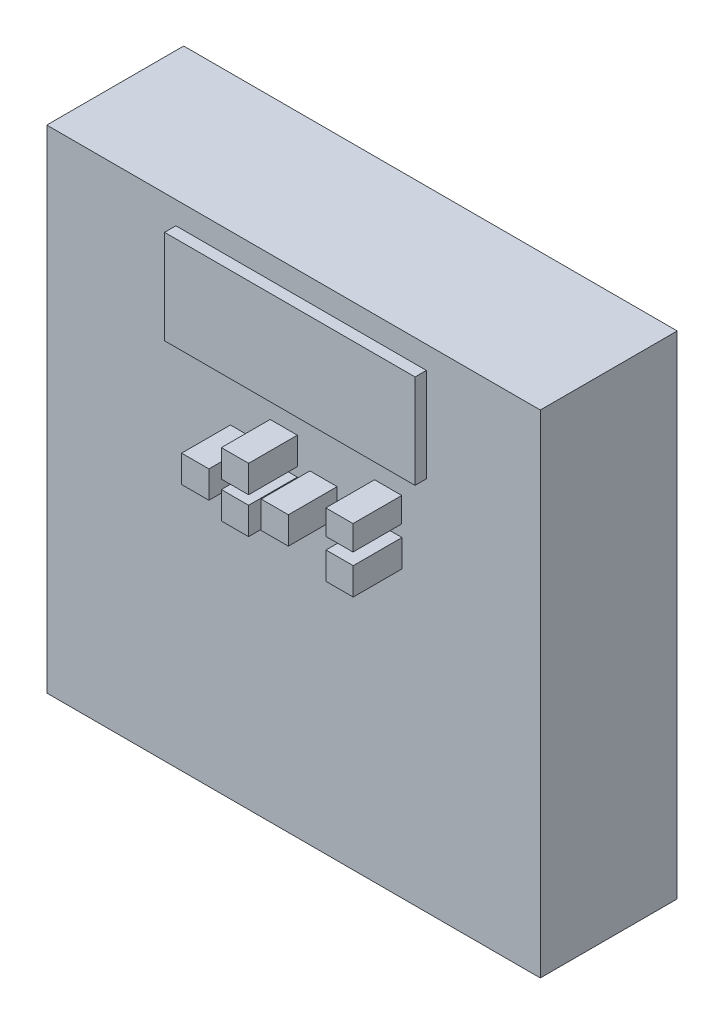
ISO-10303-21;
HEADER;
FILE_DESCRIPTION(('STEP AP214'),'2;1');
FILE_NAME('part.step','',(''),(''),'','','');
FILE_SCHEMA(('AUTOMOTIVE_DESIGN { 1 0 10303 214 1 1 1 1 }'));
ENDSEC;
DATA;
#1=APPLICATION_CONTEXT('core data for automotive mechanical design processes');
#2=APPLICATION_PROTOCOL_DEFINITION('international standard','automotive_design',2000,#1);
#3=PRODUCT_CONTEXT('',#1,'mechanical');
#4=PRODUCT('Part','Part','',(#3));
#5=PRODUCT_RELATED_PRODUCT_CATEGORY('part','',(#4));
#6=PRODUCT_DEFINITION_FORMATION('','',#4);
#7=PRODUCT_DEFINITION_CONTEXT('part definition',#1,'design');
#8=PRODUCT_DEFINITION('design','',#6,#7);
#9=PRODUCT_DEFINITION_SHAPE('','',#8);
#10=(LENGTH_UNIT() NAMED_UNIT(*) SI_UNIT(.MILLI.,.METRE.));
#11=(NAMED_UNIT(*) PLANE_ANGLE_UNIT() SI_UNIT($,.RADIAN.));
#12=(NAMED_UNIT(*) SI_UNIT($,.STERADIAN.) SOLID_ANGLE_UNIT());
#13=UNCERTAINTY_MEASURE_WITH_UNIT(LENGTH_MEASURE(1.E-05),#10,'distance_accuracy_value','');
#14=(GEOMETRIC_REPRESENTATION_CONTEXT(3) GLOBAL_UNCERTAINTY_ASSIGNED_CONTEXT((#13)) GLOBAL_UNIT_ASSIGNED_CONTEXT((#10,
#11,#12)) REPRESENTATION_CONTEXT('',''));
#15=CARTESIAN_POINT('',(0.,0.,0.));
#16=DIRECTION('',(0.,0.,1.));
#17=DIRECTION('',(1.,0.,0.));
#18=AXIS2_PLACEMENT_3D('',#15,#16,#17);
#19=CARTESIAN_POINT('',(0.,0.,30.6832));
#20=DIRECTION('',(0.,0.,1.));
#21=DIRECTION('',(1.,0.,0.));
#22=AXIS2_PLACEMENT_3D('',#19,#20,#21);
#23=PLANE('',#22);
#24=DIRECTION('',(0.,-1.,0.));
#25=VECTOR('',#24,1.);
#26=CARTESIAN_POINT('',(-55.2958,-55.11165,30.6832));
#27=LINE('',#26,#25);
#28=CARTESIAN_POINT('',(-55.2958,55.11165,30.6832));
#29=VERTEX_POINT('',#28);
#30=CARTESIAN_POINT('',(-55.2958,-55.11165,30.6832));
#31=VERTEX_POINT('',#30);
#32=EDGE_CURVE('E447',#29,#31,#27,.T.);
#33=ORIENTED_EDGE('',*,*,#32,.T.);
#34=DIRECTION('',(1.,0.,0.));
#35=VECTOR('',#34,1.);
#36=CARTESIAN_POINT('',(55.2958,-55.11165,30.6832));
#37=LINE('',#36,#35);
#38=CARTESIAN_POINT('',(55.2958,-55.11165,30.6832));
#39=VERTEX_POINT('',#38);
#40=EDGE_CURVE('E450',#31,#39,#37,.T.);
#41=ORIENTED_EDGE('',*,*,#40,.T.);
#42=DIRECTION('',(0.,1.,0.));
#43=VECTOR('',#42,1.);
#44=CARTESIAN_POINT('',(55.2958,-55.11165,30.6832));
#45=LINE('',#44,#43);
#46=CARTESIAN_POINT('',(55.2958,55.11165,30.6832));
#47=VERTEX_POINT('',#46);
#48=EDGE_CURVE('E453',#39,#47,#45,.T.);
#49=ORIENTED_EDGE('',*,*,#48,.T.);
#50=DIRECTION('',(-1.,0.,0.));
#51=VECTOR('',#50,1.);
#52=CARTESIAN_POINT('',(55.2958,55.11165,30.6832));
#53=LINE('',#52,#51);
#54=EDGE_CURVE('E455',#47,#29,#53,.T.);
#55=ORIENTED_EDGE('',*,*,#54,.T.);
#56=EDGE_LOOP('',(#33,#41,#49,#55));
#57=FACE_BOUND('',#56,.T.);
#58=DIRECTION('',(1.,0.,0.));
#59=VECTOR('',#58,1.);
#60=CARTESIAN_POINT('',(-26.3652,28.98775,30.6832));
#61=LINE('',#60,#59);
#62=CARTESIAN_POINT('',(-26.3652,28.98775,30.6832));
#63=VERTEX_POINT('',#62);
#64=CARTESIAN_POINT('',(29.7688,28.98775,30.6832));
#65=VERTEX_POINT('',#64);
#66=EDGE_CURVE('E431',#63,#65,#61,.T.);
#67=ORIENTED_EDGE('',*,*,#66,.F.);
#68=DIRECTION('',(0.,-1.,0.));
#69=VECTOR('',#68,1.);
#70=CARTESIAN_POINT('',(-26.3652,50.03165,30.6832));
#71=LINE('',#70,#69);
#72=CARTESIAN_POINT('',(-26.3652,50.03165,30.6832));
#73=VERTEX_POINT('',#72);
#74=EDGE_CURVE('E417',#73,#63,#71,.T.);
#75=ORIENTED_EDGE('',*,*,#74,.F.);
#76=DIRECTION('',(-1.,0.,0.));
#77=VECTOR('',#76,1.);
#78=CARTESIAN_POINT('',(-26.3652,50.03165,30.6832));
#79=LINE('',#78,#77);
#80=CARTESIAN_POINT('',(29.7688,50.03165,30.6832));
#81=VERTEX_POINT('',#80);
#82=EDGE_CURVE('E422',#81,#73,#79,.T.);
#83=ORIENTED_EDGE('',*,*,#82,.F.);
#84=DIRECTION('',(0.,1.,0.));
#85=VECTOR('',#84,1.);
#86=CARTESIAN_POINT('',(29.7688,50.03165,30.6832));
#87=LINE('',#86,#85);
#88=EDGE_CURVE('E433',#65,#81,#87,.T.);
#89=ORIENTED_EDGE('',*,*,#88,.F.);
#90=EDGE_LOOP('',(#67,#75,#83,#89));
#91=FACE_BOUND('',#90,.T.);
#92=DIRECTION('',(-1.,0.,0.));
#93=VECTOR('',#92,1.);
#94=CARTESIAN_POINT('',(0.850899999999997,23.00605,30.6832));
#95=LINE('',#94,#93);
#96=CARTESIAN_POINT('',(0.850899999999997,23.00605,30.6832));
#97=VERTEX_POINT('',#96);
#98=CARTESIAN_POINT('',(-5.2451,23.00605,30.6832));
#99=VERTEX_POINT('',#98);
#100=EDGE_CURVE('E402',#97,#99,#95,.T.);
#101=ORIENTED_EDGE('',*,*,#100,.F.);
#102=DIRECTION('',(0.,1.,0.));
#103=VECTOR('',#102,1.);
#104=CARTESIAN_POINT('',(0.850899999999997,16.89735,30.6832));
#105=LINE('',#104,#103);
#106=CARTESIAN_POINT('',(0.850899999999997,16.89735,30.6832));
#107=VERTEX_POINT('',#106);
#108=EDGE_CURVE('E388',#107,#97,#105,.T.);
#109=ORIENTED_EDGE('',*,*,#108,.F.);
#110=DIRECTION('',(1.,0.,0.));
#111=VECTOR('',#110,1.);
#112=CARTESIAN_POINT('',(0.850899999999997,16.89735,30.6832));
#113=LINE('',#112,#111);
#114=CARTESIAN_POINT('',(-5.2451,16.89735,30.6832));
#115=VERTEX_POINT('',#114);
#116=EDGE_CURVE('E393',#115,#107,#113,.T.);
#117=ORIENTED_EDGE('',*,*,#116,.F.);
#118=DIRECTION('',(0.,-1.,0.));
#119=VECTOR('',#118,1.);
#120=CARTESIAN_POINT('',(-5.2451,16.89735,30.6832));
#121=LINE('',#120,#119);
#122=EDGE_CURVE('E404',#99,#115,#121,.T.);
#123=ORIENTED_EDGE('',*,*,#122,.F.);
#124=EDGE_LOOP('',(#101,#109,#117,#123));
#125=FACE_BOUND('',#124,.T.);
#126=DIRECTION('',(1.,0.,0.));
#127=VECTOR('',#126,1.);
#128=CARTESIAN_POINT('',(-14.1478,11.38555,30.6832));
#129=LINE('',#128,#127);
#130=CARTESIAN_POINT('',(-14.1478,11.38555,30.6832));
#131=VERTEX_POINT('',#130);
#132=CARTESIAN_POINT('',(-8.0391,11.38555,30.6832));
#133=VERTEX_POINT('',#132);
#134=EDGE_CURVE('E373',#131,#133,#129,.T.);
#135=ORIENTED_EDGE('',*,*,#134,.F.);
#136=DIRECTION('',(0.,-1.,0.));
#137=VECTOR('',#136,1.);
#138=CARTESIAN_POINT('',(-14.1478,17.48155,30.6832));
#139=LINE('',#138,#137);
#140=CARTESIAN_POINT('',(-14.1478,17.48155,30.6832));
#141=VERTEX_POINT('',#140);
#142=EDGE_CURVE('E359',#141,#131,#139,.T.);
#143=ORIENTED_EDGE('',*,*,#142,.F.);
#144=DIRECTION('',(-1.,0.,0.));
#145=VECTOR('',#144,1.);
#146=CARTESIAN_POINT('',(-14.1478,17.48155,30.6832));
#147=LINE('',#146,#145);
#148=CARTESIAN_POINT('',(-8.0391,17.48155,30.6832));
#149=VERTEX_POINT('',#148);
#150=EDGE_CURVE('E364',#149,#141,#147,.T.);
#151=ORIENTED_EDGE('',*,*,#150,.F.);
#152=DIRECTION('',(0.,1.,0.));
#153=VECTOR('',#152,1.);
#154=CARTESIAN_POINT('',(-8.0391,17.48155,30.6832));
#155=LINE('',#154,#153);
#156=EDGE_CURVE('E375',#133,#149,#155,.T.);
#157=ORIENTED_EDGE('',*,*,#156,.F.);
#158=EDGE_LOOP('',(#135,#143,#151,#157));
#159=FACE_BOUND('',#158,.T.);
#160=DIRECTION('',(1.,0.,0.));
#161=VECTOR('',#160,1.);
#162=CARTESIAN_POINT('',(3.6703,11.38555,30.6832));
#163=LINE('',#162,#161);
#164=CARTESIAN_POINT('',(3.6703,11.38555,30.6832));
#165=VERTEX_POINT('',#164);
#166=CARTESIAN_POINT('',(9.76884,11.38555,30.6832));
#167=VERTEX_POINT('',#166);
#168=EDGE_CURVE('E344',#165,#167,#163,.T.);
#169=ORIENTED_EDGE('',*,*,#168,.F.);
#170=DIRECTION('',(0.,-1.,0.));
#171=VECTOR('',#170,1.);
#172=CARTESIAN_POINT('',(3.6703,17.48155,30.6832));
#173=LINE('',#172,#171);
#174=CARTESIAN_POINT('',(3.6703,17.48155,30.6832));
#175=VERTEX_POINT('',#174);
#176=EDGE_CURVE('E330',#175,#165,#173,.T.);
#177=ORIENTED_EDGE('',*,*,#176,.F.);
#178=DIRECTION('',(-1.,0.,0.));
#179=VECTOR('',#178,1.);
#180=CARTESIAN_POINT('',(3.6703,17.48155,30.6832));
#181=LINE('',#180,#179);
#182=CARTESIAN_POINT('',(9.76884,17.48155,30.6832));
#183=VERTEX_POINT('',#182);
#184=EDGE_CURVE('E335',#183,#175,#181,.T.);
#185=ORIENTED_EDGE('',*,*,#184,.F.);
#186=DIRECTION('',(0.,1.,0.));
#187=VECTOR('',#186,1.);
#188=CARTESIAN_POINT('',(9.76884,17.48155,30.6832));
#189=LINE('',#188,#187);
#190=EDGE_CURVE('E346',#167,#183,#189,.T.);
#191=ORIENTED_EDGE('',*,*,#190,.F.);
#192=EDGE_LOOP('',(#169,#177,#185,#191));
#193=FACE_BOUND('',#192,.T.);
#194=DIRECTION('',(1.,0.,0.));
#195=VECTOR('',#194,1.);
#196=CARTESIAN_POINT('',(-5.2451,8.76935,30.6832));
#197=LINE('',#196,#195);
#198=CARTESIAN_POINT('',(-5.2451,8.76935,30.6832));
#199=VERTEX_POINT('',#198);
#200=CARTESIAN_POINT('',(0.850899999999998,8.76935,30.6832));
#201=VERTEX_POINT('',#200);
#202=EDGE_CURVE('E315',#199,#201,#197,.T.);
#203=ORIENTED_EDGE('',*,*,#202,.F.);
#204=DIRECTION('',(0.,-1.,0.));
#205=VECTOR('',#204,1.);
#206=CARTESIAN_POINT('',(-5.2451,14.86535,30.6832));
#207=LINE('',#206,#205);
#208=CARTESIAN_POINT('',(-5.2451,14.86535,30.6832));
#209=VERTEX_POINT('',#208);
#210=EDGE_CURVE('E301',#209,#199,#207,.T.);
#211=ORIENTED_EDGE('',*,*,#210,.F.);
#212=DIRECTION('',(-1.,0.,0.));
#213=VECTOR('',#212,1.);
#214=CARTESIAN_POINT('',(-5.2451,14.86535,30.6832));
#215=LINE('',#214,#213);
#216=CARTESIAN_POINT('',(0.850899999999997,14.86535,30.6832));
#217=VERTEX_POINT('',#216);
#218=EDGE_CURVE('E306',#217,#209,#215,.T.);
#219=ORIENTED_EDGE('',*,*,#218,.F.);
#220=DIRECTION('',(0.,1.,0.));
#221=VECTOR('',#220,1.);
#222=CARTESIAN_POINT('',(0.850899999999997,14.86535,30.6832));
#223=LINE('',#222,#221);
#224=EDGE_CURVE('E317',#201,#217,#223,.T.);
#225=ORIENTED_EDGE('',*,*,#224,.F.);
#226=EDGE_LOOP('',(#203,#211,#219,#225));
#227=FACE_BOUND('',#226,.T.);
#228=DIRECTION('',(1.,0.,0.));
#229=VECTOR('',#228,1.);
#230=CARTESIAN_POINT('',(18.15084,17.48155,30.6832));
#231=LINE('',#230,#229);
#232=CARTESIAN_POINT('',(18.15084,17.48155,30.6832));
#233=VERTEX_POINT('',#232);
#234=CARTESIAN_POINT('',(24.24684,17.48155,30.6832));
#235=VERTEX_POINT('',#234);
#236=EDGE_CURVE('E273',#233,#235,#231,.T.);
#237=ORIENTED_EDGE('',*,*,#236,.F.);
#238=DIRECTION('',(0.,-1.,0.));
#239=VECTOR('',#238,1.);
#240=CARTESIAN_POINT('',(18.15084,23.00605,30.6832));
#241=LINE('',#240,#239);
#242=CARTESIAN_POINT('',(18.15084,23.00605,30.6832));
#243=VERTEX_POINT('',#242);
#244=EDGE_CURVE('E270',#243,#233,#241,.T.);
#245=ORIENTED_EDGE('',*,*,#244,.F.);
#246=DIRECTION('',(-1.,0.,0.));
#247=VECTOR('',#246,1.);
#248=CARTESIAN_POINT('',(18.15084,23.00605,30.6832));
#249=LINE('',#248,#247);
#250=CARTESIAN_POINT('',(24.24684,23.00605,30.6832));
#251=VERTEX_POINT('',#250);
#252=EDGE_CURVE('E282',#251,#243,#249,.T.);
#253=ORIENTED_EDGE('',*,*,#252,.F.);
#254=DIRECTION('',(0.,1.,0.));
#255=VECTOR('',#254,1.);
#256=CARTESIAN_POINT('',(24.24684,23.00605,30.6832));
#257=LINE('',#256,#255);
#258=EDGE_CURVE('E290',#235,#251,#257,.T.);
#259=ORIENTED_EDGE('',*,*,#258,.F.);
#260=EDGE_LOOP('',(#237,#245,#253,#259));
#261=FACE_BOUND('',#260,.T.);
#262=DIRECTION('',(1.,0.,0.));
#263=VECTOR('',#262,1.);
#264=CARTESIAN_POINT('',(18.1991,8.76935,30.6832));
#265=LINE('',#264,#263);
#266=CARTESIAN_POINT('',(18.1991,8.76935,30.6832));
#267=VERTEX_POINT('',#266);
#268=CARTESIAN_POINT('',(24.2951,8.76935,30.6832));
#269=VERTEX_POINT('',#268);
#270=EDGE_CURVE('E859',#267,#269,#265,.T.);
#271=ORIENTED_EDGE('',*,*,#270,.F.);
#272=DIRECTION('',(0.,-1.,0.));
#273=VECTOR('',#272,1.);
#274=CARTESIAN_POINT('',(18.1991,14.86535,30.6832));
#275=LINE('',#274,#273);
#276=CARTESIAN_POINT('',(18.1991,14.86535,30.6832));
#277=VERTEX_POINT('',#276);
#278=EDGE_CURVE('E268',#277,#267,#275,.T.);
#279=ORIENTED_EDGE('',*,*,#278,.F.);
#280=DIRECTION('',(-1.,0.,0.));
#281=VECTOR('',#280,1.);
#282=CARTESIAN_POINT('',(18.1991,14.86535,30.6832));
#283=LINE('',#282,#281);
#284=CARTESIAN_POINT('',(24.2951,14.86535,30.6832));
#285=VERTEX_POINT('',#284);
#286=EDGE_CURVE('E264',#285,#277,#283,.T.);
#287=ORIENTED_EDGE('',*,*,#286,.F.);
#288=DIRECTION('',(0.,1.,0.));
#289=VECTOR('',#288,1.);
#290=CARTESIAN_POINT('',(24.2951,14.86535,30.6832));
#291=LINE('',#290,#289);
#292=EDGE_CURVE('E856',#269,#285,#291,.T.);
#293=ORIENTED_EDGE('',*,*,#292,.F.);
#294=EDGE_LOOP('',(#271,#279,#287,#293));
#295=FACE_BOUND('',#294,.T.);
#296=ADVANCED_FACE('F35',(#57,#91,#125,#159,#193,#227,#261,#295),#23,.T.);
#297=CARTESIAN_POINT('',(-55.2958,-55.11165,30.6832));
#298=DIRECTION('',(1.,0.,0.));
#299=DIRECTION('',(0.,0.,-1.));
#300=AXIS2_PLACEMENT_3D('',#297,#298,#299);
#301=PLANE('',#300);
#302=DIRECTION('',(0.,-1.,0.));
#303=VECTOR('',#302,1.);
#304=CARTESIAN_POINT('',(-55.2958,-55.11165,0.));
#305=LINE('',#304,#303);
#306=CARTESIAN_POINT('',(-55.2958,55.11165,0.));
#307=VERTEX_POINT('',#306);
#308=CARTESIAN_POINT('',(-55.2958,-55.11165,0.));
#309=VERTEX_POINT('',#308);
#310=EDGE_CURVE('E446',#307,#309,#305,.T.);
#311=ORIENTED_EDGE('',*,*,#310,.T.);
#312=DIRECTION('',(0.,0.,-1.));
#313=VECTOR('',#312,1.);
#314=CARTESIAN_POINT('',(-55.2958,-55.11165,30.6832));
#315=LINE('',#314,#313);
#316=EDGE_CURVE('E11',#31,#309,#315,.T.);
#317=ORIENTED_EDGE('',*,*,#316,.F.);
#318=ORIENTED_EDGE('',*,*,#32,.F.);
#319=DIRECTION('',(0.,0.,-1.));
#320=VECTOR('',#319,1.);
#321=CARTESIAN_POINT('',(-55.2958,55.11165,30.6832));
#322=LINE('',#321,#320);
#323=EDGE_CURVE('E457',#29,#307,#322,.T.);
#324=ORIENTED_EDGE('',*,*,#323,.T.);
#325=EDGE_LOOP('',(#311,#317,#318,#324));
#326=FACE_BOUND('',#325,.T.);
#327=ADVANCED_FACE('F37',(#326),#301,.F.);
#328=CARTESIAN_POINT('',(55.2958,-55.11165,30.6832));
#329=DIRECTION('',(0.,1.,0.));
#330=DIRECTION('',(0.,0.,1.));
#331=AXIS2_PLACEMENT_3D('',#328,#329,#330);
#332=PLANE('',#331);
#333=DIRECTION('',(1.,0.,0.));
#334=VECTOR('',#333,1.);
#335=CARTESIAN_POINT('',(55.2958,-55.11165,0.));
#336=LINE('',#335,#334);
#337=CARTESIAN_POINT('',(55.2958,-55.11165,0.));
#338=VERTEX_POINT('',#337);
#339=EDGE_CURVE('E460',#309,#338,#336,.T.);
#340=ORIENTED_EDGE('',*,*,#339,.T.);
#341=DIRECTION('',(0.,0.,-1.));
#342=VECTOR('',#341,1.);
#343=CARTESIAN_POINT('',(55.2958,-55.11165,30.6832));
#344=LINE('',#343,#342);
#345=EDGE_CURVE('E43',#39,#338,#344,.T.);
#346=ORIENTED_EDGE('',*,*,#345,.F.);
#347=ORIENTED_EDGE('',*,*,#40,.F.);
#348=ORIENTED_EDGE('',*,*,#316,.T.);
#349=EDGE_LOOP('',(#340,#346,#347,#348));
#350=FACE_BOUND('',#349,.T.);
#351=ADVANCED_FACE('F490',(#350),#332,.F.);
#352=CARTESIAN_POINT('',(55.2958,-55.11165,30.6832));
#353=DIRECTION('',(-1.,0.,0.));
#354=DIRECTION('',(0.,0.,1.));
#355=AXIS2_PLACEMENT_3D('',#352,#353,#354);
#356=PLANE('',#355);
#357=DIRECTION('',(0.,1.,0.));
#358=VECTOR('',#357,1.);
#359=CARTESIAN_POINT('',(55.2958,-55.11165,0.));
#360=LINE('',#359,#358);
#361=CARTESIAN_POINT('',(55.2958,55.11165,0.));
#362=VERTEX_POINT('',#361);
#363=EDGE_CURVE('E462',#338,#362,#360,.T.);
#364=ORIENTED_EDGE('',*,*,#363,.T.);
#365=DIRECTION('',(0.,0.,-1.));
#366=VECTOR('',#365,1.);
#367=CARTESIAN_POINT('',(55.2958,55.11165,30.6832));
#368=LINE('',#367,#366);
#369=EDGE_CURVE('E467',#47,#362,#368,.T.);
#370=ORIENTED_EDGE('',*,*,#369,.F.);
#371=ORIENTED_EDGE('',*,*,#48,.F.);
#372=ORIENTED_EDGE('',*,*,#345,.T.);
#373=EDGE_LOOP('',(#364,#370,#371,#372));
#374=FACE_BOUND('',#373,.T.);
#375=ADVANCED_FACE('F474',(#374),#356,.F.);
#376=CARTESIAN_POINT('',(55.2958,55.11165,30.6832));
#377=DIRECTION('',(0.,-1.,0.));
#378=DIRECTION('',(0.,0.,-1.));
#379=AXIS2_PLACEMENT_3D('',#376,#377,#378);
#380=PLANE('',#379);
#381=DIRECTION('',(-1.,0.,0.));
#382=VECTOR('',#381,1.);
#383=CARTESIAN_POINT('',(55.2958,55.11165,0.));
#384=LINE('',#383,#382);
#385=EDGE_CURVE('E451',#362,#307,#384,.T.);
#386=ORIENTED_EDGE('',*,*,#385,.T.);
#387=ORIENTED_EDGE('',*,*,#323,.F.);
#388=ORIENTED_EDGE('',*,*,#54,.F.);
#389=ORIENTED_EDGE('',*,*,#369,.T.);
#390=EDGE_LOOP('',(#386,#387,#388,#389));
#391=FACE_BOUND('',#390,.T.);
#392=ADVANCED_FACE('F483',(#391),#380,.F.);
#393=CARTESIAN_POINT('',(0.,0.,0.));
#394=DIRECTION('',(0.,0.,1.));
#395=DIRECTION('',(1.,0.,0.));
#396=AXIS2_PLACEMENT_3D('',#393,#394,#395);
#397=PLANE('',#396);
#398=ORIENTED_EDGE('',*,*,#310,.F.);
#399=ORIENTED_EDGE('',*,*,#385,.F.);
#400=ORIENTED_EDGE('',*,*,#363,.F.);
#401=ORIENTED_EDGE('',*,*,#339,.F.);
#402=EDGE_LOOP('',(#398,#399,#400,#401));
#403=FACE_BOUND('',#402,.T.);
#404=ADVANCED_FACE('F480',(#403),#397,.F.);
#405=CARTESIAN_POINT('',(-26.3652,50.03165,33.2232));
#406=DIRECTION('',(1.,0.,0.));
#407=DIRECTION('',(0.,0.,-1.));
#408=AXIS2_PLACEMENT_3D('',#405,#406,#407);
#409=PLANE('',#408);
#410=ORIENTED_EDGE('',*,*,#74,.T.);
#411=DIRECTION('',(0.,0.,-1.));
#412=VECTOR('',#411,1.);
#413=CARTESIAN_POINT('',(-26.3652,28.98775,33.2232));
#414=LINE('',#413,#412);
#415=CARTESIAN_POINT('',(-26.3652,28.98775,33.2232));
#416=VERTEX_POINT('',#415);
#417=EDGE_CURVE('E444',#416,#63,#414,.T.);
#418=ORIENTED_EDGE('',*,*,#417,.F.);
#419=DIRECTION('',(0.,-1.,0.));
#420=VECTOR('',#419,1.);
#421=CARTESIAN_POINT('',(-26.3652,50.03165,33.2232));
#422=LINE('',#421,#420);
#423=CARTESIAN_POINT('',(-26.3652,50.03165,33.2232));
#424=VERTEX_POINT('',#423);
#425=EDGE_CURVE('E418',#424,#416,#422,.T.);
#426=ORIENTED_EDGE('',*,*,#425,.F.);
#427=DIRECTION('',(0.,0.,-1.));
#428=VECTOR('',#427,1.);
#429=CARTESIAN_POINT('',(-26.3652,50.03165,33.2232));
#430=LINE('',#429,#428);
#431=EDGE_CURVE('E428',#424,#73,#430,.T.);
#432=ORIENTED_EDGE('',*,*,#431,.T.);
#433=EDGE_LOOP('',(#410,#418,#426,#432));
#434=FACE_BOUND('',#433,.T.);
#435=ADVANCED_FACE('F505',(#434),#409,.F.);
#436=CARTESIAN_POINT('',(-26.3652,28.98775,33.2232));
#437=DIRECTION('',(0.,1.,0.));
#438=DIRECTION('',(0.,0.,1.));
#439=AXIS2_PLACEMENT_3D('',#436,#437,#438);
#440=PLANE('',#439);
#441=ORIENTED_EDGE('',*,*,#66,.T.);
#442=DIRECTION('',(0.,0.,-1.));
#443=VECTOR('',#442,1.);
#444=CARTESIAN_POINT('',(29.7688,28.98775,33.2232));
#445=LINE('',#444,#443);
#446=CARTESIAN_POINT('',(29.7688,28.98775,33.2232));
#447=VERTEX_POINT('',#446);
#448=EDGE_CURVE('E441',#447,#65,#445,.T.);
#449=ORIENTED_EDGE('',*,*,#448,.F.);
#450=DIRECTION('',(1.,0.,0.));
#451=VECTOR('',#450,1.);
#452=CARTESIAN_POINT('',(-26.3652,28.98775,33.2232));
#453=LINE('',#452,#451);
#454=EDGE_CURVE('E421',#416,#447,#453,.T.);
#455=ORIENTED_EDGE('',*,*,#454,.F.);
#456=ORIENTED_EDGE('',*,*,#417,.T.);
#457=EDGE_LOOP('',(#441,#449,#455,#456));
#458=FACE_BOUND('',#457,.T.);
#459=ADVANCED_FACE('F530',(#458),#440,.F.);
#460=CARTESIAN_POINT('',(29.7688,50.03165,33.2232));
#461=DIRECTION('',(-1.,0.,0.));
#462=DIRECTION('',(0.,-1.,0.));
#463=AXIS2_PLACEMENT_3D('',#460,#461,#462);
#464=PLANE('',#463);
#465=ORIENTED_EDGE('',*,*,#88,.T.);
#466=DIRECTION('',(0.,0.,-1.));
#467=VECTOR('',#466,1.);
#468=CARTESIAN_POINT('',(29.7688,50.03165,33.2232));
#469=LINE('',#468,#467);
#470=CARTESIAN_POINT('',(29.7688,50.03165,33.2232));
#471=VERTEX_POINT('',#470);
#472=EDGE_CURVE('E439',#471,#81,#469,.T.);
#473=ORIENTED_EDGE('',*,*,#472,.F.);
#474=DIRECTION('',(0.,1.,0.));
#475=VECTOR('',#474,1.);
#476=CARTESIAN_POINT('',(29.7688,50.03165,33.2232));
#477=LINE('',#476,#475);
#478=EDGE_CURVE('E424',#447,#471,#477,.T.);
#479=ORIENTED_EDGE('',*,*,#478,.F.);
#480=ORIENTED_EDGE('',*,*,#448,.T.);
#481=EDGE_LOOP('',(#465,#473,#479,#480));
#482=FACE_BOUND('',#481,.T.);
#483=ADVANCED_FACE('F537',(#482),#464,.F.);
#484=CARTESIAN_POINT('',(-26.3652,50.03165,33.2232));
#485=DIRECTION('',(0.,-1.,0.));
#486=DIRECTION('',(0.,0.,-1.));
#487=AXIS2_PLACEMENT_3D('',#484,#485,#486);
#488=PLANE('',#487);
#489=ORIENTED_EDGE('',*,*,#82,.T.);
#490=ORIENTED_EDGE('',*,*,#431,.F.);
#491=DIRECTION('',(-1.,0.,0.));
#492=VECTOR('',#491,1.);
#493=CARTESIAN_POINT('',(-26.3652,50.03165,33.2232));
#494=LINE('',#493,#492);
#495=EDGE_CURVE('E426',#471,#424,#494,.T.);
#496=ORIENTED_EDGE('',*,*,#495,.F.);
#497=ORIENTED_EDGE('',*,*,#472,.T.);
#498=EDGE_LOOP('',(#489,#490,#496,#497));
#499=FACE_BOUND('',#498,.T.);
#500=ADVANCED_FACE('F544',(#499),#488,.F.);
#501=CARTESIAN_POINT('',(0.,0.,33.2232));
#502=DIRECTION('',(0.,0.,1.));
#503=DIRECTION('',(1.,0.,0.));
#504=AXIS2_PLACEMENT_3D('',#501,#502,#503);
#505=PLANE('',#504);
#506=ORIENTED_EDGE('',*,*,#425,.T.);
#507=ORIENTED_EDGE('',*,*,#454,.T.);
#508=ORIENTED_EDGE('',*,*,#478,.T.);
#509=ORIENTED_EDGE('',*,*,#495,.T.);
#510=EDGE_LOOP('',(#506,#507,#508,#509));
#511=FACE_BOUND('',#510,.T.);
#512=ADVANCED_FACE('F552',(#511),#505,.T.);
#513=CARTESIAN_POINT('',(0.850899999999997,16.89735,41.6052));
#514=DIRECTION('',(-1.,0.,0.));
#515=DIRECTION('',(0.,0.,1.));
#516=AXIS2_PLACEMENT_3D('',#513,#514,#515);
#517=PLANE('',#516);
#518=ORIENTED_EDGE('',*,*,#108,.T.);
#519=DIRECTION('',(0.,0.,-1.));
#520=VECTOR('',#519,1.);
#521=CARTESIAN_POINT('',(0.850899999999997,23.00605,41.6052));
#522=LINE('',#521,#520);
#523=CARTESIAN_POINT('',(0.850899999999997,23.00605,41.6052));
#524=VERTEX_POINT('',#523);
#525=EDGE_CURVE('E415',#524,#97,#522,.T.);
#526=ORIENTED_EDGE('',*,*,#525,.F.);
#527=DIRECTION('',(0.,1.,0.));
#528=VECTOR('',#527,1.);
#529=CARTESIAN_POINT('',(0.850899999999997,16.89735,41.6052));
#530=LINE('',#529,#528);
#531=CARTESIAN_POINT('',(0.850899999999997,16.89735,41.6052));
#532=VERTEX_POINT('',#531);
#533=EDGE_CURVE('E389',#532,#524,#530,.T.);
#534=ORIENTED_EDGE('',*,*,#533,.F.);
#535=DIRECTION('',(0.,0.,-1.));
#536=VECTOR('',#535,1.);
#537=CARTESIAN_POINT('',(0.850899999999997,16.89735,41.6052));
#538=LINE('',#537,#536);
#539=EDGE_CURVE('E399',#532,#107,#538,.T.);
#540=ORIENTED_EDGE('',*,*,#539,.T.);
#541=EDGE_LOOP('',(#518,#526,#534,#540));
#542=FACE_BOUND('',#541,.T.);
#543=ADVANCED_FACE('F560',(#542),#517,.F.);
#544=CARTESIAN_POINT('',(0.850899999999997,23.00605,41.6052));
#545=DIRECTION('',(0.,-1.,0.));
#546=DIRECTION('',(1.,0.,0.));
#547=AXIS2_PLACEMENT_3D('',#544,#545,#546);
#548=PLANE('',#547);
#549=ORIENTED_EDGE('',*,*,#100,.T.);
#550=DIRECTION('',(0.,0.,-1.));
#551=VECTOR('',#550,1.);
#552=CARTESIAN_POINT('',(-5.2451,23.00605,41.6052));
#553=LINE('',#552,#551);
#554=CARTESIAN_POINT('',(-5.2451,23.00605,41.6052));
#555=VERTEX_POINT('',#554);
#556=EDGE_CURVE('E412',#555,#99,#553,.T.);
#557=ORIENTED_EDGE('',*,*,#556,.F.);
#558=DIRECTION('',(-1.,0.,0.));
#559=VECTOR('',#558,1.);
#560=CARTESIAN_POINT('',(0.850899999999997,23.00605,41.6052));
#561=LINE('',#560,#559);
#562=EDGE_CURVE('E392',#524,#555,#561,.T.);
#563=ORIENTED_EDGE('',*,*,#562,.F.);
#564=ORIENTED_EDGE('',*,*,#525,.T.);
#565=EDGE_LOOP('',(#549,#557,#563,#564));
#566=FACE_BOUND('',#565,.T.);
#567=ADVANCED_FACE('F566',(#566),#548,.F.);
#568=CARTESIAN_POINT('',(-5.2451,16.89735,41.6052));
#569=DIRECTION('',(1.,0.,0.));
#570=DIRECTION('',(0.,0.,-1.));
#571=AXIS2_PLACEMENT_3D('',#568,#569,#570);
#572=PLANE('',#571);
#573=ORIENTED_EDGE('',*,*,#122,.T.);
#574=DIRECTION('',(0.,0.,-1.));
#575=VECTOR('',#574,1.);
#576=CARTESIAN_POINT('',(-5.2451,16.89735,41.6052));
#577=LINE('',#576,#575);
#578=CARTESIAN_POINT('',(-5.2451,16.89735,41.6052));
#579=VERTEX_POINT('',#578);
#580=EDGE_CURVE('E410',#579,#115,#577,.T.);
#581=ORIENTED_EDGE('',*,*,#580,.F.);
#582=DIRECTION('',(0.,-1.,0.));
#583=VECTOR('',#582,1.);
#584=CARTESIAN_POINT('',(-5.2451,16.89735,41.6052));
#585=LINE('',#584,#583);
#586=EDGE_CURVE('E395',#555,#579,#585,.T.);
#587=ORIENTED_EDGE('',*,*,#586,.F.);
#588=ORIENTED_EDGE('',*,*,#556,.T.);
#589=EDGE_LOOP('',(#573,#581,#587,#588));
#590=FACE_BOUND('',#589,.T.);
#591=ADVANCED_FACE('F573',(#590),#572,.F.);
#592=CARTESIAN_POINT('',(0.850899999999997,16.89735,41.6052));
#593=DIRECTION('',(0.,1.,0.));
#594=DIRECTION('',(0.,0.,1.));
#595=AXIS2_PLACEMENT_3D('',#592,#593,#594);
#596=PLANE('',#595);
#597=ORIENTED_EDGE('',*,*,#116,.T.);
#598=ORIENTED_EDGE('',*,*,#539,.F.);
#599=DIRECTION('',(1.,0.,0.));
#600=VECTOR('',#599,1.);
#601=CARTESIAN_POINT('',(0.850899999999997,16.89735,41.6052));
#602=LINE('',#601,#600);
#603=EDGE_CURVE('E397',#579,#532,#602,.T.);
#604=ORIENTED_EDGE('',*,*,#603,.F.);
#605=ORIENTED_EDGE('',*,*,#580,.T.);
#606=EDGE_LOOP('',(#597,#598,#604,#605));
#607=FACE_BOUND('',#606,.T.);
#608=ADVANCED_FACE('F581',(#607),#596,.F.);
#609=CARTESIAN_POINT('',(0.,0.,41.6052));
#610=DIRECTION('',(0.,0.,1.));
#611=DIRECTION('',(1.,0.,0.));
#612=AXIS2_PLACEMENT_3D('',#609,#610,#611);
#613=PLANE('',#612);
#614=ORIENTED_EDGE('',*,*,#533,.T.);
#615=ORIENTED_EDGE('',*,*,#562,.T.);
#616=ORIENTED_EDGE('',*,*,#586,.T.);
#617=ORIENTED_EDGE('',*,*,#603,.T.);
#618=EDGE_LOOP('',(#614,#615,#616,#617));
#619=FACE_BOUND('',#618,.T.);
#620=ADVANCED_FACE('F589',(#619),#613,.T.);
#621=CARTESIAN_POINT('',(-14.1478,17.48155,41.6052));
#622=DIRECTION('',(1.,0.,0.));
#623=DIRECTION('',(0.,0.,-1.));
#624=AXIS2_PLACEMENT_3D('',#621,#622,#623);
#625=PLANE('',#624);
#626=ORIENTED_EDGE('',*,*,#142,.T.);
#627=DIRECTION('',(0.,0.,-1.));
#628=VECTOR('',#627,1.);
#629=CARTESIAN_POINT('',(-14.1478,11.38555,41.6052));
#630=LINE('',#629,#628);
#631=CARTESIAN_POINT('',(-14.1478,11.38555,41.6052));
#632=VERTEX_POINT('',#631);
#633=EDGE_CURVE('E386',#632,#131,#630,.T.);
#634=ORIENTED_EDGE('',*,*,#633,.F.);
#635=DIRECTION('',(0.,-1.,0.));
#636=VECTOR('',#635,1.);
#637=CARTESIAN_POINT('',(-14.1478,17.48155,41.6052));
#638=LINE('',#637,#636);
#639=CARTESIAN_POINT('',(-14.1478,17.48155,41.6052));
#640=VERTEX_POINT('',#639);
#641=EDGE_CURVE('E360',#640,#632,#638,.T.);
#642=ORIENTED_EDGE('',*,*,#641,.F.);
#643=DIRECTION('',(0.,0.,-1.));
#644=VECTOR('',#643,1.);
#645=CARTESIAN_POINT('',(-14.1478,17.48155,41.6052));
#646=LINE('',#645,#644);
#647=EDGE_CURVE('E370',#640,#141,#646,.T.);
#648=ORIENTED_EDGE('',*,*,#647,.T.);
#649=EDGE_LOOP('',(#626,#634,#642,#648));
#650=FACE_BOUND('',#649,.T.);
#651=ADVANCED_FACE('F597',(#650),#625,.F.);
#652=CARTESIAN_POINT('',(-14.1478,11.38555,41.6052));
#653=DIRECTION('',(0.,1.,0.));
#654=DIRECTION('',(0.,0.,1.));
#655=AXIS2_PLACEMENT_3D('',#652,#653,#654);
#656=PLANE('',#655);
#657=ORIENTED_EDGE('',*,*,#134,.T.);
#658=DIRECTION('',(0.,0.,-1.));
#659=VECTOR('',#658,1.);
#660=CARTESIAN_POINT('',(-8.0391,11.38555,41.6052));
#661=LINE('',#660,#659);
#662=CARTESIAN_POINT('',(-8.0391,11.38555,41.6052));
#663=VERTEX_POINT('',#662);
#664=EDGE_CURVE('E383',#663,#133,#661,.T.);
#665=ORIENTED_EDGE('',*,*,#664,.F.);
#666=DIRECTION('',(1.,0.,0.));
#667=VECTOR('',#666,1.);
#668=CARTESIAN_POINT('',(-14.1478,11.38555,41.6052));
#669=LINE('',#668,#667);
#670=EDGE_CURVE('E363',#632,#663,#669,.T.);
#671=ORIENTED_EDGE('',*,*,#670,.F.);
#672=ORIENTED_EDGE('',*,*,#633,.T.);
#673=EDGE_LOOP('',(#657,#665,#671,#672));
#674=FACE_BOUND('',#673,.T.);
#675=ADVANCED_FACE('F605',(#674),#656,.F.);
#676=CARTESIAN_POINT('',(-8.0391,17.48155,41.6052));
#677=DIRECTION('',(-1.,0.,0.));
#678=DIRECTION('',(0.,0.,1.));
#679=AXIS2_PLACEMENT_3D('',#676,#677,#678);
#680=PLANE('',#679);
#681=ORIENTED_EDGE('',*,*,#156,.T.);
#682=DIRECTION('',(0.,0.,-1.));
#683=VECTOR('',#682,1.);
#684=CARTESIAN_POINT('',(-8.0391,17.48155,41.6052));
#685=LINE('',#684,#683);
#686=CARTESIAN_POINT('',(-8.0391,17.48155,41.6052));
#687=VERTEX_POINT('',#686);
#688=EDGE_CURVE('E381',#687,#149,#685,.T.);
#689=ORIENTED_EDGE('',*,*,#688,.F.);
#690=DIRECTION('',(0.,1.,0.));
#691=VECTOR('',#690,1.);
#692=CARTESIAN_POINT('',(-8.0391,17.48155,41.6052));
#693=LINE('',#692,#691);
#694=EDGE_CURVE('E366',#663,#687,#693,.T.);
#695=ORIENTED_EDGE('',*,*,#694,.F.);
#696=ORIENTED_EDGE('',*,*,#664,.T.);
#697=EDGE_LOOP('',(#681,#689,#695,#696));
#698=FACE_BOUND('',#697,.T.);
#699=ADVANCED_FACE('F613',(#698),#680,.F.);
#700=CARTESIAN_POINT('',(-14.1478,17.48155,41.6052));
#701=DIRECTION('',(0.,-1.,0.));
#702=DIRECTION('',(0.,0.,-1.));
#703=AXIS2_PLACEMENT_3D('',#700,#701,#702);
#704=PLANE('',#703);
#705=ORIENTED_EDGE('',*,*,#150,.T.);
#706=ORIENTED_EDGE('',*,*,#647,.F.);
#707=DIRECTION('',(-1.,0.,0.));
#708=VECTOR('',#707,1.);
#709=CARTESIAN_POINT('',(-14.1478,17.48155,41.6052));
#710=LINE('',#709,#708);
#711=EDGE_CURVE('E368',#687,#640,#710,.T.);
#712=ORIENTED_EDGE('',*,*,#711,.F.);
#713=ORIENTED_EDGE('',*,*,#688,.T.);
#714=EDGE_LOOP('',(#705,#706,#712,#713));
#715=FACE_BOUND('',#714,.T.);
#716=ADVANCED_FACE('F621',(#715),#704,.F.);
#717=CARTESIAN_POINT('',(0.,0.,41.6052));
#718=DIRECTION('',(0.,0.,1.));
#719=DIRECTION('',(1.,0.,0.));
#720=AXIS2_PLACEMENT_3D('',#717,#718,#719);
#721=PLANE('',#720);
#722=ORIENTED_EDGE('',*,*,#641,.T.);
#723=ORIENTED_EDGE('',*,*,#670,.T.);
#724=ORIENTED_EDGE('',*,*,#694,.T.);
#725=ORIENTED_EDGE('',*,*,#711,.T.);
#726=EDGE_LOOP('',(#722,#723,#724,#725));
#727=FACE_BOUND('',#726,.T.);
#728=ADVANCED_FACE('F629',(#727),#721,.T.);
#729=CARTESIAN_POINT('',(3.6703,17.48155,41.6052));
#730=DIRECTION('',(1.,0.,0.));
#731=DIRECTION('',(0.,1.,0.));
#732=AXIS2_PLACEMENT_3D('',#729,#730,#731);
#733=PLANE('',#732);
#734=ORIENTED_EDGE('',*,*,#176,.T.);
#735=DIRECTION('',(0.,0.,-1.));
#736=VECTOR('',#735,1.);
#737=CARTESIAN_POINT('',(3.6703,11.38555,41.6052));
#738=LINE('',#737,#736);
#739=CARTESIAN_POINT('',(3.6703,11.38555,41.6052));
#740=VERTEX_POINT('',#739);
#741=EDGE_CURVE('E357',#740,#165,#738,.T.);
#742=ORIENTED_EDGE('',*,*,#741,.F.);
#743=DIRECTION('',(0.,-1.,0.));
#744=VECTOR('',#743,1.);
#745=CARTESIAN_POINT('',(3.6703,17.48155,41.6052));
#746=LINE('',#745,#744);
#747=CARTESIAN_POINT('',(3.6703,17.48155,41.6052));
#748=VERTEX_POINT('',#747);
#749=EDGE_CURVE('E331',#748,#740,#746,.T.);
#750=ORIENTED_EDGE('',*,*,#749,.F.);
#751=DIRECTION('',(0.,0.,-1.));
#752=VECTOR('',#751,1.);
#753=CARTESIAN_POINT('',(3.6703,17.48155,41.6052));
#754=LINE('',#753,#752);
#755=EDGE_CURVE('E341',#748,#175,#754,.T.);
#756=ORIENTED_EDGE('',*,*,#755,.T.);
#757=EDGE_LOOP('',(#734,#742,#750,#756));
#758=FACE_BOUND('',#757,.T.);
#759=ADVANCED_FACE('F637',(#758),#733,.F.);
#760=CARTESIAN_POINT('',(3.6703,11.38555,41.6052));
#761=DIRECTION('',(0.,1.,0.));
#762=DIRECTION('',(0.,0.,1.));
#763=AXIS2_PLACEMENT_3D('',#760,#761,#762);
#764=PLANE('',#763);
#765=ORIENTED_EDGE('',*,*,#168,.T.);
#766=DIRECTION('',(0.,0.,-1.));
#767=VECTOR('',#766,1.);
#768=CARTESIAN_POINT('',(9.76884,11.38555,41.6052));
#769=LINE('',#768,#767);
#770=CARTESIAN_POINT('',(9.76884,11.38555,41.6052));
#771=VERTEX_POINT('',#770);
#772=EDGE_CURVE('E354',#771,#167,#769,.T.);
#773=ORIENTED_EDGE('',*,*,#772,.F.);
#774=DIRECTION('',(1.,0.,0.));
#775=VECTOR('',#774,1.);
#776=CARTESIAN_POINT('',(3.6703,11.38555,41.6052));
#777=LINE('',#776,#775);
#778=EDGE_CURVE('E334',#740,#771,#777,.T.);
#779=ORIENTED_EDGE('',*,*,#778,.F.);
#780=ORIENTED_EDGE('',*,*,#741,.T.);
#781=EDGE_LOOP('',(#765,#773,#779,#780));
#782=FACE_BOUND('',#781,.T.);
#783=ADVANCED_FACE('F645',(#782),#764,.F.);
#784=CARTESIAN_POINT('',(9.76884,17.48155,41.6052));
#785=DIRECTION('',(-1.,0.,0.));
#786=DIRECTION('',(0.,0.,1.));
#787=AXIS2_PLACEMENT_3D('',#784,#785,#786);
#788=PLANE('',#787);
#789=ORIENTED_EDGE('',*,*,#190,.T.);
#790=DIRECTION('',(0.,0.,-1.));
#791=VECTOR('',#790,1.);
#792=CARTESIAN_POINT('',(9.76884,17.48155,41.6052));
#793=LINE('',#792,#791);
#794=CARTESIAN_POINT('',(9.76884,17.48155,41.6052));
#795=VERTEX_POINT('',#794);
#796=EDGE_CURVE('E352',#795,#183,#793,.T.);
#797=ORIENTED_EDGE('',*,*,#796,.F.);
#798=DIRECTION('',(0.,1.,0.));
#799=VECTOR('',#798,1.);
#800=CARTESIAN_POINT('',(9.76884,17.48155,41.6052));
#801=LINE('',#800,#799);
#802=EDGE_CURVE('E337',#771,#795,#801,.T.);
#803=ORIENTED_EDGE('',*,*,#802,.F.);
#804=ORIENTED_EDGE('',*,*,#772,.T.);
#805=EDGE_LOOP('',(#789,#797,#803,#804));
#806=FACE_BOUND('',#805,.T.);
#807=ADVANCED_FACE('F653',(#806),#788,.F.);
#808=CARTESIAN_POINT('',(3.6703,17.48155,41.6052));
#809=DIRECTION('',(0.,-1.,0.));
#810=DIRECTION('',(0.,0.,-1.));
#811=AXIS2_PLACEMENT_3D('',#808,#809,#810);
#812=PLANE('',#811);
#813=ORIENTED_EDGE('',*,*,#184,.T.);
#814=ORIENTED_EDGE('',*,*,#755,.F.);
#815=DIRECTION('',(-1.,0.,0.));
#816=VECTOR('',#815,1.);
#817=CARTESIAN_POINT('',(3.6703,17.48155,41.6052));
#818=LINE('',#817,#816);
#819=EDGE_CURVE('E339',#795,#748,#818,.T.);
#820=ORIENTED_EDGE('',*,*,#819,.F.);
#821=ORIENTED_EDGE('',*,*,#796,.T.);
#822=EDGE_LOOP('',(#813,#814,#820,#821));
#823=FACE_BOUND('',#822,.T.);
#824=ADVANCED_FACE('F661',(#823),#812,.F.);
#825=CARTESIAN_POINT('',(0.,0.,41.6052));
#826=DIRECTION('',(0.,0.,1.));
#827=DIRECTION('',(1.,0.,0.));
#828=AXIS2_PLACEMENT_3D('',#825,#826,#827);
#829=PLANE('',#828);
#830=ORIENTED_EDGE('',*,*,#749,.T.);
#831=ORIENTED_EDGE('',*,*,#778,.T.);
#832=ORIENTED_EDGE('',*,*,#802,.T.);
#833=ORIENTED_EDGE('',*,*,#819,.T.);
#834=EDGE_LOOP('',(#830,#831,#832,#833));
#835=FACE_BOUND('',#834,.T.);
#836=ADVANCED_FACE('F669',(#835),#829,.T.);
#837=CARTESIAN_POINT('',(-5.2451,14.86535,41.6052));
#838=DIRECTION('',(1.,0.,0.));
#839=DIRECTION('',(0.,1.,0.));
#840=AXIS2_PLACEMENT_3D('',#837,#838,#839);
#841=PLANE('',#840);
#842=ORIENTED_EDGE('',*,*,#210,.T.);
#843=DIRECTION('',(0.,0.,-1.));
#844=VECTOR('',#843,1.);
#845=CARTESIAN_POINT('',(-5.2451,8.76935,41.6052));
#846=LINE('',#845,#844);
#847=CARTESIAN_POINT('',(-5.2451,8.76935,41.6052));
#848=VERTEX_POINT('',#847);
#849=EDGE_CURVE('E328',#848,#199,#846,.T.);
#850=ORIENTED_EDGE('',*,*,#849,.F.);
#851=DIRECTION('',(0.,-1.,0.));
#852=VECTOR('',#851,1.);
#853=CARTESIAN_POINT('',(-5.2451,14.86535,41.6052));
#854=LINE('',#853,#852);
#855=CARTESIAN_POINT('',(-5.2451,14.86535,41.6052));
#856=VERTEX_POINT('',#855);
#857=EDGE_CURVE('E302',#856,#848,#854,.T.);
#858=ORIENTED_EDGE('',*,*,#857,.F.);
#859=DIRECTION('',(0.,0.,-1.));
#860=VECTOR('',#859,1.);
#861=CARTESIAN_POINT('',(-5.2451,14.86535,41.6052));
#862=LINE('',#861,#860);
#863=EDGE_CURVE('E312',#856,#209,#862,.T.);
#864=ORIENTED_EDGE('',*,*,#863,.T.);
#865=EDGE_LOOP('',(#842,#850,#858,#864));
#866=FACE_BOUND('',#865,.T.);
#867=ADVANCED_FACE('F677',(#866),#841,.F.);
#868=CARTESIAN_POINT('',(-5.2451,8.76935,41.6052));
#869=DIRECTION('',(0.,1.,0.));
#870=DIRECTION('',(0.,0.,1.));
#871=AXIS2_PLACEMENT_3D('',#868,#869,#870);
#872=PLANE('',#871);
#873=ORIENTED_EDGE('',*,*,#202,.T.);
#874=DIRECTION('',(0.,0.,-1.));
#875=VECTOR('',#874,1.);
#876=CARTESIAN_POINT('',(0.850899999999998,8.76935,41.6052));
#877=LINE('',#876,#875);
#878=CARTESIAN_POINT('',(0.850899999999998,8.76935,41.6052));
#879=VERTEX_POINT('',#878);
#880=EDGE_CURVE('E325',#879,#201,#877,.T.);
#881=ORIENTED_EDGE('',*,*,#880,.F.);
#882=DIRECTION('',(1.,0.,0.));
#883=VECTOR('',#882,1.);
#884=CARTESIAN_POINT('',(-5.2451,8.76935,41.6052));
#885=LINE('',#884,#883);
#886=EDGE_CURVE('E305',#848,#879,#885,.T.);
#887=ORIENTED_EDGE('',*,*,#886,.F.);
#888=ORIENTED_EDGE('',*,*,#849,.T.);
#889=EDGE_LOOP('',(#873,#881,#887,#888));
#890=FACE_BOUND('',#889,.T.);
#891=ADVANCED_FACE('F685',(#890),#872,.F.);
#892=CARTESIAN_POINT('',(0.850899999999997,14.86535,41.6052));
#893=DIRECTION('',(-1.,0.,0.));
#894=DIRECTION('',(0.,-1.,0.));
#895=AXIS2_PLACEMENT_3D('',#892,#893,#894);
#896=PLANE('',#895);
#897=ORIENTED_EDGE('',*,*,#224,.T.);
#898=DIRECTION('',(0.,0.,-1.));
#899=VECTOR('',#898,1.);
#900=CARTESIAN_POINT('',(0.850899999999997,14.86535,41.6052));
#901=LINE('',#900,#899);
#902=CARTESIAN_POINT('',(0.850899999999997,14.86535,41.6052));
#903=VERTEX_POINT('',#902);
#904=EDGE_CURVE('E323',#903,#217,#901,.T.);
#905=ORIENTED_EDGE('',*,*,#904,.F.);
#906=DIRECTION('',(0.,1.,0.));
#907=VECTOR('',#906,1.);
#908=CARTESIAN_POINT('',(0.850899999999997,14.86535,41.6052));
#909=LINE('',#908,#907);
#910=EDGE_CURVE('E308',#879,#903,#909,.T.);
#911=ORIENTED_EDGE('',*,*,#910,.F.);
#912=ORIENTED_EDGE('',*,*,#880,.T.);
#913=EDGE_LOOP('',(#897,#905,#911,#912));
#914=FACE_BOUND('',#913,.T.);
#915=ADVANCED_FACE('F693',(#914),#896,.F.);
#916=CARTESIAN_POINT('',(-5.2451,14.86535,41.6052));
#917=DIRECTION('',(0.,-1.,0.));
#918=DIRECTION('',(0.,0.,-1.));
#919=AXIS2_PLACEMENT_3D('',#916,#917,#918);
#920=PLANE('',#919);
#921=ORIENTED_EDGE('',*,*,#218,.T.);
#922=ORIENTED_EDGE('',*,*,#863,.F.);
#923=DIRECTION('',(-1.,0.,0.));
#924=VECTOR('',#923,1.);
#925=CARTESIAN_POINT('',(-5.2451,14.86535,41.6052));
#926=LINE('',#925,#924);
#927=EDGE_CURVE('E310',#903,#856,#926,.T.);
#928=ORIENTED_EDGE('',*,*,#927,.F.);
#929=ORIENTED_EDGE('',*,*,#904,.T.);
#930=EDGE_LOOP('',(#921,#922,#928,#929));
#931=FACE_BOUND('',#930,.T.);
#932=ADVANCED_FACE('F701',(#931),#920,.F.);
#933=CARTESIAN_POINT('',(0.,0.,41.6052));
#934=DIRECTION('',(0.,0.,1.));
#935=DIRECTION('',(1.,0.,0.));
#936=AXIS2_PLACEMENT_3D('',#933,#934,#935);
#937=PLANE('',#936);
#938=ORIENTED_EDGE('',*,*,#857,.T.);
#939=ORIENTED_EDGE('',*,*,#886,.T.);
#940=ORIENTED_EDGE('',*,*,#910,.T.);
#941=ORIENTED_EDGE('',*,*,#927,.T.);
#942=EDGE_LOOP('',(#938,#939,#940,#941));
#943=FACE_BOUND('',#942,.T.);
#944=ADVANCED_FACE('F709',(#943),#937,.T.);
#945=CARTESIAN_POINT('',(18.15084,23.00605,41.6052));
#946=DIRECTION('',(1.,0.,0.));
#947=DIRECTION('',(0.,0.,-1.));
#948=AXIS2_PLACEMENT_3D('',#945,#946,#947);
#949=PLANE('',#948);
#950=ORIENTED_EDGE('',*,*,#244,.T.);
#951=DIRECTION('',(0.,0.,-1.));
#952=VECTOR('',#951,1.);
#953=CARTESIAN_POINT('',(18.15084,17.48155,41.6052));
#954=LINE('',#953,#952);
#955=CARTESIAN_POINT('',(18.15084,17.48155,41.6052));
#956=VERTEX_POINT('',#955);
#957=EDGE_CURVE('E299',#956,#233,#954,.T.);
#958=ORIENTED_EDGE('',*,*,#957,.F.);
#959=DIRECTION('',(0.,-1.,0.));
#960=VECTOR('',#959,1.);
#961=CARTESIAN_POINT('',(18.15084,23.00605,41.6052));
#962=LINE('',#961,#960);
#963=CARTESIAN_POINT('',(18.15084,23.00605,41.6052));
#964=VERTEX_POINT('',#963);
#965=EDGE_CURVE('E278',#964,#956,#962,.T.);
#966=ORIENTED_EDGE('',*,*,#965,.F.);
#967=DIRECTION('',(0.,0.,-1.));
#968=VECTOR('',#967,1.);
#969=CARTESIAN_POINT('',(18.15084,23.00605,41.6052));
#970=LINE('',#969,#968);
#971=EDGE_CURVE('E287',#964,#243,#970,.T.);
#972=ORIENTED_EDGE('',*,*,#971,.T.);
#973=EDGE_LOOP('',(#950,#958,#966,#972));
#974=FACE_BOUND('',#973,.T.);
#975=ADVANCED_FACE('F717',(#974),#949,.F.);
#976=CARTESIAN_POINT('',(18.15084,17.48155,41.6052));
#977=DIRECTION('',(0.,1.,0.));
#978=DIRECTION('',(0.,0.,1.));
#979=AXIS2_PLACEMENT_3D('',#976,#977,#978);
#980=PLANE('',#979);
#981=ORIENTED_EDGE('',*,*,#236,.T.);
#982=DIRECTION('',(0.,0.,-1.));
#983=VECTOR('',#982,1.);
#984=CARTESIAN_POINT('',(24.24684,17.48155,41.6052));
#985=LINE('',#984,#983);
#986=CARTESIAN_POINT('',(24.24684,17.48155,41.6052));
#987=VERTEX_POINT('',#986);
#988=EDGE_CURVE('E296',#987,#235,#985,.T.);
#989=ORIENTED_EDGE('',*,*,#988,.F.);
#990=DIRECTION('',(1.,0.,0.));
#991=VECTOR('',#990,1.);
#992=CARTESIAN_POINT('',(18.15084,17.48155,41.6052));
#993=LINE('',#992,#991);
#994=EDGE_CURVE('E281',#956,#987,#993,.T.);
#995=ORIENTED_EDGE('',*,*,#994,.F.);
#996=ORIENTED_EDGE('',*,*,#957,.T.);
#997=EDGE_LOOP('',(#981,#989,#995,#996));
#998=FACE_BOUND('',#997,.T.);
#999=ADVANCED_FACE('F725',(#998),#980,.F.);
#1000=CARTESIAN_POINT('',(24.24684,23.00605,41.6052));
#1001=DIRECTION('',(-1.,0.,0.));
#1002=DIRECTION('',(0.,0.,1.));
#1003=AXIS2_PLACEMENT_3D('',#1000,#1001,#1002);
#1004=PLANE('',#1003);
#1005=ORIENTED_EDGE('',*,*,#258,.T.);
#1006=DIRECTION('',(0.,0.,-1.));
#1007=VECTOR('',#1006,1.);
#1008=CARTESIAN_POINT('',(24.24684,23.00605,41.6052));
#1009=LINE('',#1008,#1007);
#1010=CARTESIAN_POINT('',(24.24684,23.00605,41.6052));
#1011=VERTEX_POINT('',#1010);
#1012=EDGE_CURVE('E58',#1011,#251,#1009,.T.);
#1013=ORIENTED_EDGE('',*,*,#1012,.F.);
#1014=DIRECTION('',(0.,1.,0.));
#1015=VECTOR('',#1014,1.);
#1016=CARTESIAN_POINT('',(24.24684,23.00605,41.6052));
#1017=LINE('',#1016,#1015);
#1018=EDGE_CURVE('E284',#987,#1011,#1017,.T.);
#1019=ORIENTED_EDGE('',*,*,#1018,.F.);
#1020=ORIENTED_EDGE('',*,*,#988,.T.);
#1021=EDGE_LOOP('',(#1005,#1013,#1019,#1020));
#1022=FACE_BOUND('',#1021,.T.);
#1023=ADVANCED_FACE('F733',(#1022),#1004,.F.);
#1024=CARTESIAN_POINT('',(18.15084,23.00605,41.6052));
#1025=DIRECTION('',(0.,-1.,0.));
#1026=DIRECTION('',(0.,0.,-1.));
#1027=AXIS2_PLACEMENT_3D('',#1024,#1025,#1026);
#1028=PLANE('',#1027);
#1029=ORIENTED_EDGE('',*,*,#252,.T.);
#1030=ORIENTED_EDGE('',*,*,#971,.F.);
#1031=DIRECTION('',(-1.,0.,0.));
#1032=VECTOR('',#1031,1.);
#1033=CARTESIAN_POINT('',(18.15084,23.00605,41.6052));
#1034=LINE('',#1033,#1032);
#1035=EDGE_CURVE('E286',#1011,#964,#1034,.T.);
#1036=ORIENTED_EDGE('',*,*,#1035,.F.);
#1037=ORIENTED_EDGE('',*,*,#1012,.T.);
#1038=EDGE_LOOP('',(#1029,#1030,#1036,#1037));
#1039=FACE_BOUND('',#1038,.T.);
#1040=ADVANCED_FACE('F741',(#1039),#1028,.F.);
#1041=CARTESIAN_POINT('',(0.,0.,41.6052));
#1042=DIRECTION('',(0.,0.,1.));
#1043=DIRECTION('',(1.,0.,0.));
#1044=AXIS2_PLACEMENT_3D('',#1041,#1042,#1043);
#1045=PLANE('',#1044);
#1046=ORIENTED_EDGE('',*,*,#965,.T.);
#1047=ORIENTED_EDGE('',*,*,#994,.T.);
#1048=ORIENTED_EDGE('',*,*,#1018,.T.);
#1049=ORIENTED_EDGE('',*,*,#1035,.T.);
#1050=EDGE_LOOP('',(#1046,#1047,#1048,#1049));
#1051=FACE_BOUND('',#1050,.T.);
#1052=ADVANCED_FACE('F749',(#1051),#1045,.T.);
#1053=CARTESIAN_POINT('',(18.1991,14.86535,41.6052));
#1054=DIRECTION('',(1.,0.,0.));
#1055=DIRECTION('',(0.,1.,0.));
#1056=AXIS2_PLACEMENT_3D('',#1053,#1054,#1055);
#1057=PLANE('',#1056);
#1058=ORIENTED_EDGE('',*,*,#278,.T.);
#1059=DIRECTION('',(0.,0.,-1.));
#1060=VECTOR('',#1059,1.);
#1061=CARTESIAN_POINT('',(18.1991,8.76935,41.6052));
#1062=LINE('',#1061,#1060);
#1063=CARTESIAN_POINT('',(18.1991,8.76935,41.6052));
#1064=VERTEX_POINT('',#1063);
#1065=EDGE_CURVE('E249',#1064,#267,#1062,.T.);
#1066=ORIENTED_EDGE('',*,*,#1065,.F.);
#1067=DIRECTION('',(0.,-1.,0.));
#1068=VECTOR('',#1067,1.);
#1069=CARTESIAN_POINT('',(18.1991,14.86535,41.6052));
#1070=LINE('',#1069,#1068);
#1071=CARTESIAN_POINT('',(18.1991,14.86535,41.6052));
#1072=VERTEX_POINT('',#1071);
#1073=EDGE_CURVE('E256',#1072,#1064,#1070,.T.);
#1074=ORIENTED_EDGE('',*,*,#1073,.F.);
#1075=DIRECTION('',(0.,0.,-1.));
#1076=VECTOR('',#1075,1.);
#1077=CARTESIAN_POINT('',(18.1991,14.86535,41.6052));
#1078=LINE('',#1077,#1076);
#1079=EDGE_CURVE('E853',#1072,#277,#1078,.T.);
#1080=ORIENTED_EDGE('',*,*,#1079,.T.);
#1081=EDGE_LOOP('',(#1058,#1066,#1074,#1080));
#1082=FACE_BOUND('',#1081,.T.);
#1083=ADVANCED_FACE('F266',(#1082),#1057,.F.);
#1084=CARTESIAN_POINT('',(18.1991,8.76935,41.6052));
#1085=DIRECTION('',(0.,1.,0.));
#1086=DIRECTION('',(0.,0.,1.));
#1087=AXIS2_PLACEMENT_3D('',#1084,#1085,#1086);
#1088=PLANE('',#1087);
#1089=ORIENTED_EDGE('',*,*,#270,.T.);
#1090=DIRECTION('',(0.,0.,-1.));
#1091=VECTOR('',#1090,1.);
#1092=CARTESIAN_POINT('',(24.2951,8.76935,41.6052));
#1093=LINE('',#1092,#1091);
#1094=CARTESIAN_POINT('',(24.2951,8.76935,41.6052));
#1095=VERTEX_POINT('',#1094);
#1096=EDGE_CURVE('E252',#1095,#269,#1093,.T.);
#1097=ORIENTED_EDGE('',*,*,#1096,.F.);
#1098=DIRECTION('',(1.,0.,0.));
#1099=VECTOR('',#1098,1.);
#1100=CARTESIAN_POINT('',(18.1991,8.76935,41.6052));
#1101=LINE('',#1100,#1099);
#1102=EDGE_CURVE('E245',#1064,#1095,#1101,.T.);
#1103=ORIENTED_EDGE('',*,*,#1102,.F.);
#1104=ORIENTED_EDGE('',*,*,#1065,.T.);
#1105=EDGE_LOOP('',(#1089,#1097,#1103,#1104));
#1106=FACE_BOUND('',#1105,.T.);
#1107=ADVANCED_FACE('F247',(#1106),#1088,.F.);
#1108=CARTESIAN_POINT('',(24.2951,14.86535,41.6052));
#1109=DIRECTION('',(-1.,0.,0.));
#1110=DIRECTION('',(0.,0.,1.));
#1111=AXIS2_PLACEMENT_3D('',#1108,#1109,#1110);
#1112=PLANE('',#1111);
#1113=ORIENTED_EDGE('',*,*,#292,.T.);
#1114=DIRECTION('',(0.,0.,-1.));
#1115=VECTOR('',#1114,1.);
#1116=CARTESIAN_POINT('',(24.2951,14.86535,41.6052));
#1117=LINE('',#1116,#1115);
#1118=CARTESIAN_POINT('',(24.2951,14.86535,41.6052));
#1119=VERTEX_POINT('',#1118);
#1120=EDGE_CURVE('E50',#1119,#285,#1117,.T.);
#1121=ORIENTED_EDGE('',*,*,#1120,.F.);
#1122=DIRECTION('',(0.,1.,0.));
#1123=VECTOR('',#1122,1.);
#1124=CARTESIAN_POINT('',(24.2951,14.86535,41.6052));
#1125=LINE('',#1124,#1123);
#1126=EDGE_CURVE('E255',#1095,#1119,#1125,.T.);
#1127=ORIENTED_EDGE('',*,*,#1126,.F.);
#1128=ORIENTED_EDGE('',*,*,#1096,.T.);
#1129=EDGE_LOOP('',(#1113,#1121,#1127,#1128));
#1130=FACE_BOUND('',#1129,.T.);
#1131=ADVANCED_FACE('F769',(#1130),#1112,.F.);
#1132=CARTESIAN_POINT('',(18.1991,14.86535,41.6052));
#1133=DIRECTION('',(0.,-1.,0.));
#1134=DIRECTION('',(0.,0.,-1.));
#1135=AXIS2_PLACEMENT_3D('',#1132,#1133,#1134);
#1136=PLANE('',#1135);
#1137=ORIENTED_EDGE('',*,*,#286,.T.);
#1138=ORIENTED_EDGE('',*,*,#1079,.F.);
#1139=DIRECTION('',(-1.,0.,0.));
#1140=VECTOR('',#1139,1.);
#1141=CARTESIAN_POINT('',(18.1991,14.86535,41.6052));
#1142=LINE('',#1141,#1140);
#1143=EDGE_CURVE('E260',#1119,#1072,#1142,.T.);
#1144=ORIENTED_EDGE('',*,*,#1143,.F.);
#1145=ORIENTED_EDGE('',*,*,#1120,.T.);
#1146=EDGE_LOOP('',(#1137,#1138,#1144,#1145));
#1147=FACE_BOUND('',#1146,.T.);
#1148=ADVANCED_FACE('F776',(#1147),#1136,.F.);
#1149=CARTESIAN_POINT('',(0.,0.,41.6052));
#1150=DIRECTION('',(0.,0.,1.));
#1151=DIRECTION('',(1.,0.,0.));
#1152=AXIS2_PLACEMENT_3D('',#1149,#1150,#1151);
#1153=PLANE('',#1152);
#1154=ORIENTED_EDGE('',*,*,#1073,.T.);
#1155=ORIENTED_EDGE('',*,*,#1102,.T.);
#1156=ORIENTED_EDGE('',*,*,#1126,.T.);
#1157=ORIENTED_EDGE('',*,*,#1143,.T.);
#1158=EDGE_LOOP('',(#1154,#1155,#1156,#1157));
#1159=FACE_BOUND('',#1158,.T.);
#1160=ADVANCED_FACE('F259',(#1159),#1153,.T.);
#1161=CLOSED_SHELL('',(#296,#327,#351,#375,#392,#404,#435,#459,#483,#500,#512,#543,#567,#591,
#608,#620,#651,#675,#699,#716,#728,#759,#783,#807,#824,#836,#867,#891,#915,#932,#944,#975,#999,
#1023,#1040,#1052,#1083,#1107,#1131,#1148,#1160));
#1162=MANIFOLD_SOLID_BREP('B2',#1161);
#1163=ADVANCED_BREP_SHAPE_REPRESENTATION('',(#18,#1162),#14);
#1164=SHAPE_DEFINITION_REPRESENTATION(#9,#1163);
ENDSEC;
END-ISO-10303-21;
